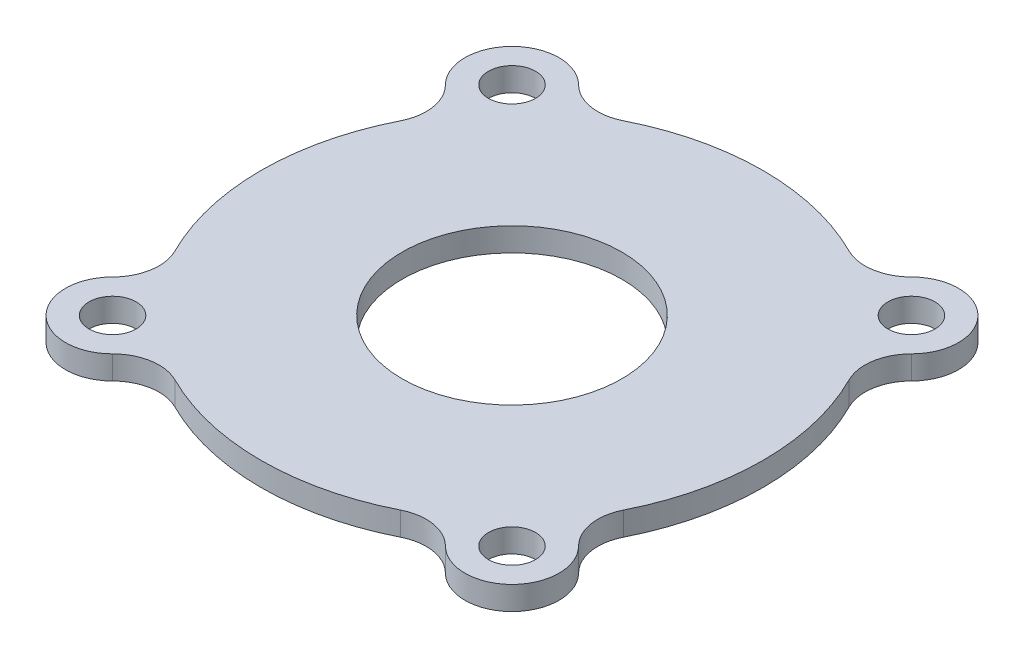
ISO-10303-21;
HEADER;
FILE_DESCRIPTION(('STEP AP214'),'2;1');
FILE_NAME('part.step','',(''),(''),'','','');
FILE_SCHEMA(('AUTOMOTIVE_DESIGN { 1 0 10303 214 1 1 1 1 }'));
ENDSEC;
DATA;
#1=APPLICATION_CONTEXT('core data for automotive mechanical design processes');
#2=APPLICATION_PROTOCOL_DEFINITION('international standard','automotive_design',2000,#1);
#3=PRODUCT_CONTEXT('',#1,'mechanical');
#4=PRODUCT('Part','Part','',(#3));
#5=PRODUCT_RELATED_PRODUCT_CATEGORY('part','',(#4));
#6=PRODUCT_DEFINITION_FORMATION('','',#4);
#7=PRODUCT_DEFINITION_CONTEXT('part definition',#1,'design');
#8=PRODUCT_DEFINITION('design','',#6,#7);
#9=PRODUCT_DEFINITION_SHAPE('','',#8);
#10=(LENGTH_UNIT() NAMED_UNIT(*) SI_UNIT(.MILLI.,.METRE.));
#11=(NAMED_UNIT(*) PLANE_ANGLE_UNIT() SI_UNIT($,.RADIAN.));
#12=(NAMED_UNIT(*) SI_UNIT($,.STERADIAN.) SOLID_ANGLE_UNIT());
#13=UNCERTAINTY_MEASURE_WITH_UNIT(LENGTH_MEASURE(1.E-05),#10,'distance_accuracy_value','');
#14=(GEOMETRIC_REPRESENTATION_CONTEXT(3) GLOBAL_UNCERTAINTY_ASSIGNED_CONTEXT((#13)) GLOBAL_UNIT_ASSIGNED_CONTEXT((#10,
#11,#12)) REPRESENTATION_CONTEXT('',''));
#15=CARTESIAN_POINT('',(0.,0.,0.));
#16=DIRECTION('',(0.,0.,1.));
#17=DIRECTION('',(1.,0.,0.));
#18=AXIS2_PLACEMENT_3D('',#15,#16,#17);
#19=CARTESIAN_POINT('',(0.,0.,0.));
#20=DIRECTION('',(0.,1.,0.));
#21=DIRECTION('',(0.,0.,1.));
#22=AXIS2_PLACEMENT_3D('',#19,#20,#21);
#23=PLANE('',#22);
#24=CARTESIAN_POINT('',(-1.47196168001604E-13,0.,-1.0794385653451E-13));
#25=DIRECTION('',(0.,1.,0.));
#26=DIRECTION('',(0.,0.,1.));
#27=AXIS2_PLACEMENT_3D('',#24,#25,#26);
#28=CIRCLE('',#27,7.);
#29=CARTESIAN_POINT('',(-1.47196168001604E-13,0.,6.99999999999989));
#30=VERTEX_POINT('',#29);
#31=EDGE_CURVE('E311',#30,#30,#28,.T.);
#32=ORIENTED_EDGE('',*,*,#31,.T.);
#33=EDGE_LOOP('',(#32));
#34=FACE_BOUND('',#33,.T.);
#35=CARTESIAN_POINT('',(-1.47196168001604E-13,0.,-1.0794385653451E-13));
#36=DIRECTION('',(0.,1.,0.));
#37=DIRECTION('',(0.,0.,1.));
#38=AXIS2_PLACEMENT_3D('',#35,#36,#37);
#39=CIRCLE('',#38,11.);
#40=CARTESIAN_POINT('',(-1.47196168001604E-13,0.,10.9999999999999));
#41=VERTEX_POINT('',#40);
#42=EDGE_CURVE('E11',#41,#41,#39,.T.);
#43=ORIENTED_EDGE('',*,*,#42,.F.);
#44=EDGE_LOOP('',(#43));
#45=FACE_BOUND('',#44,.T.);
#46=ADVANCED_FACE('F45',(#34,#45),#23,.F.);
#47=CARTESIAN_POINT('',(-12.7279220613578,1.5,12.7279220613579));
#48=DIRECTION('',(0.,-1.,0.));
#49=DIRECTION('',(0.,0.,-1.));
#50=AXIS2_PLACEMENT_3D('',#47,#48,#49);
#51=CYLINDRICAL_SURFACE('',#50,2.99999999999999);
#52=CARTESIAN_POINT('',(-12.7279220613578,0.,12.7279220613579));
#53=DIRECTION('',(0.,1.,0.));
#54=DIRECTION('',(0.,0.,1.));
#55=AXIS2_PLACEMENT_3D('',#52,#53,#54);
#56=CIRCLE('',#55,2.99999999999999);
#57=CARTESIAN_POINT('',(-10.6066017177982,0.,14.8492424049175));
#58=VERTEX_POINT('',#57);
#59=CARTESIAN_POINT('',(-14.8492424049175,0.,10.6066017177982));
#60=VERTEX_POINT('',#59);
#61=EDGE_CURVE('E261',#58,#60,#56,.F.);
#62=ORIENTED_EDGE('',*,*,#61,.F.);
#63=DIRECTION('',(0.,-1.,0.));
#64=VECTOR('',#63,1.);
#65=CARTESIAN_POINT('',(-10.6066017177982,1.5,14.8492424049175));
#66=LINE('',#65,#64);
#67=CARTESIAN_POINT('',(-10.6066017177982,1.5,14.8492424049175));
#68=VERTEX_POINT('',#67);
#69=EDGE_CURVE('E55',#68,#58,#66,.T.);
#70=ORIENTED_EDGE('',*,*,#69,.F.);
#71=CARTESIAN_POINT('',(-12.7279220613578,1.5,12.7279220613579));
#72=DIRECTION('',(0.,1.,0.));
#73=DIRECTION('',(0.,0.,1.));
#74=AXIS2_PLACEMENT_3D('',#71,#72,#73);
#75=CIRCLE('',#74,2.99999999999999);
#76=CARTESIAN_POINT('',(-14.8492424049175,1.5,10.6066017177982));
#77=VERTEX_POINT('',#76);
#78=EDGE_CURVE('E212',#68,#77,#75,.F.);
#79=ORIENTED_EDGE('',*,*,#78,.T.);
#80=DIRECTION('',(0.,-1.,0.));
#81=VECTOR('',#80,1.);
#82=CARTESIAN_POINT('',(-14.8492424049175,1.5,10.6066017177982));
#83=LINE('',#82,#81);
#84=EDGE_CURVE('E63',#77,#60,#83,.T.);
#85=ORIENTED_EDGE('',*,*,#84,.T.);
#86=EDGE_LOOP('',(#62,#70,#79,#85));
#87=FACE_BOUND('',#86,.T.);
#88=ADVANCED_FACE('F47',(#87),#51,.T.);
#89=CARTESIAN_POINT('',(-8.51247778889959,1.5,16.9433663338161));
#90=DIRECTION('',(0.,-1.,0.));
#91=DIRECTION('',(0.,0.,-1.));
#92=AXIS2_PLACEMENT_3D('',#89,#90,#91);
#93=CYLINDRICAL_SURFACE('',#92,2.96153846153845);
#94=CARTESIAN_POINT('',(-8.51247778889959,0.,16.9433663338161));
#95=DIRECTION('',(0.,1.,0.));
#96=DIRECTION('',(0.,0.,1.));
#97=AXIS2_PLACEMENT_3D('',#94,#95,#96);
#98=CIRCLE('',#97,2.96153846153845);
#99=CARTESIAN_POINT('',(-7.18294271842236,0.,14.297039340502));
#100=VERTEX_POINT('',#99);
#101=EDGE_CURVE('E264',#58,#100,#98,.F.);
#102=ORIENTED_EDGE('',*,*,#101,.T.);
#103=DIRECTION('',(0.,-1.,0.));
#104=VECTOR('',#103,1.);
#105=CARTESIAN_POINT('',(-7.18294271842236,1.5,14.297039340502));
#106=LINE('',#105,#104);
#107=CARTESIAN_POINT('',(-7.18294271842236,1.5,14.297039340502));
#108=VERTEX_POINT('',#107);
#109=EDGE_CURVE('E369',#108,#100,#106,.T.);
#110=ORIENTED_EDGE('',*,*,#109,.F.);
#111=CARTESIAN_POINT('',(-8.51247778889959,1.5,16.9433663338161));
#112=DIRECTION('',(0.,1.,0.));
#113=DIRECTION('',(0.,0.,1.));
#114=AXIS2_PLACEMENT_3D('',#111,#112,#113);
#115=CIRCLE('',#114,2.96153846153845);
#116=EDGE_CURVE('E204',#68,#108,#115,.F.);
#117=ORIENTED_EDGE('',*,*,#116,.F.);
#118=ORIENTED_EDGE('',*,*,#69,.T.);
#119=EDGE_LOOP('',(#102,#110,#117,#118));
#120=FACE_BOUND('',#119,.T.);
#121=ADVANCED_FACE('F375',(#120),#93,.F.);
#122=CARTESIAN_POINT('',(-1.47196168001604E-13,1.5,-1.0794385653451E-13));
#123=DIRECTION('',(0.,-1.,0.));
#124=DIRECTION('',(0.,0.,-1.));
#125=AXIS2_PLACEMENT_3D('',#122,#123,#124);
#126=CYLINDRICAL_SURFACE('',#125,16.);
#127=CARTESIAN_POINT('',(-1.47196168001604E-13,0.,-1.0794385653451E-13));
#128=DIRECTION('',(0.,1.,0.));
#129=DIRECTION('',(0.,0.,1.));
#130=AXIS2_PLACEMENT_3D('',#127,#128,#129);
#131=CIRCLE('',#130,16.);
#132=CARTESIAN_POINT('',(7.18294271842233,0.,14.297039340502));
#133=VERTEX_POINT('',#132);
#134=EDGE_CURVE('E268',#100,#133,#131,.T.);
#135=ORIENTED_EDGE('',*,*,#134,.T.);
#136=DIRECTION('',(0.,-1.,0.));
#137=VECTOR('',#136,1.);
#138=CARTESIAN_POINT('',(7.18294271842233,1.5,14.297039340502));
#139=LINE('',#138,#137);
#140=CARTESIAN_POINT('',(7.18294271842233,1.5,14.297039340502));
#141=VERTEX_POINT('',#140);
#142=EDGE_CURVE('E366',#141,#133,#139,.T.);
#143=ORIENTED_EDGE('',*,*,#142,.F.);
#144=CARTESIAN_POINT('',(-1.47196168001604E-13,1.5,-1.0794385653451E-13));
#145=DIRECTION('',(0.,1.,0.));
#146=DIRECTION('',(0.,0.,1.));
#147=AXIS2_PLACEMENT_3D('',#144,#145,#146);
#148=CIRCLE('',#147,16.);
#149=EDGE_CURVE('E192',#108,#141,#148,.T.);
#150=ORIENTED_EDGE('',*,*,#149,.F.);
#151=ORIENTED_EDGE('',*,*,#109,.T.);
#152=EDGE_LOOP('',(#135,#143,#150,#151));
#153=FACE_BOUND('',#152,.T.);
#154=ADVANCED_FACE('F386',(#153),#126,.T.);
#155=CARTESIAN_POINT('',(8.51247778889959,1.5,16.9433663338161));
#156=DIRECTION('',(0.,-1.,0.));
#157=DIRECTION('',(0.,0.,-1.));
#158=AXIS2_PLACEMENT_3D('',#155,#156,#157);
#159=CYLINDRICAL_SURFACE('',#158,2.96153846153846);
#160=CARTESIAN_POINT('',(8.51247778889959,0.,16.9433663338161));
#161=DIRECTION('',(0.,1.,0.));
#162=DIRECTION('',(0.,0.,1.));
#163=AXIS2_PLACEMENT_3D('',#160,#161,#162);
#164=CIRCLE('',#163,2.96153846153846);
#165=CARTESIAN_POINT('',(10.6066017177982,0.,14.8492424049175));
#166=VERTEX_POINT('',#165);
#167=EDGE_CURVE('E272',#166,#133,#164,.T.);
#168=ORIENTED_EDGE('',*,*,#167,.F.);
#169=DIRECTION('',(0.,-1.,0.));
#170=VECTOR('',#169,1.);
#171=CARTESIAN_POINT('',(10.6066017177982,1.5,14.8492424049175));
#172=LINE('',#171,#170);
#173=CARTESIAN_POINT('',(10.6066017177982,1.5,14.8492424049175));
#174=VERTEX_POINT('',#173);
#175=EDGE_CURVE('E363',#174,#166,#172,.T.);
#176=ORIENTED_EDGE('',*,*,#175,.F.);
#177=CARTESIAN_POINT('',(8.51247778889959,1.5,16.9433663338161));
#178=DIRECTION('',(0.,1.,0.));
#179=DIRECTION('',(0.,0.,1.));
#180=AXIS2_PLACEMENT_3D('',#177,#178,#179);
#181=CIRCLE('',#180,2.96153846153846);
#182=EDGE_CURVE('E203',#174,#141,#181,.T.);
#183=ORIENTED_EDGE('',*,*,#182,.T.);
#184=ORIENTED_EDGE('',*,*,#142,.T.);
#185=EDGE_LOOP('',(#168,#176,#183,#184));
#186=FACE_BOUND('',#185,.T.);
#187=ADVANCED_FACE('F466',(#186),#159,.F.);
#188=CARTESIAN_POINT('',(12.7279220613579,1.5,12.7279220613578));
#189=DIRECTION('',(0.,-1.,0.));
#190=DIRECTION('',(0.,0.,-1.));
#191=AXIS2_PLACEMENT_3D('',#188,#189,#190);
#192=CYLINDRICAL_SURFACE('',#191,3.00000000000001);
#193=CARTESIAN_POINT('',(12.7279220613579,0.,12.7279220613578));
#194=DIRECTION('',(0.,1.,0.));
#195=DIRECTION('',(0.,0.,1.));
#196=AXIS2_PLACEMENT_3D('',#193,#194,#195);
#197=CIRCLE('',#196,3.00000000000001);
#198=CARTESIAN_POINT('',(14.8492424049175,0.,10.6066017177982));
#199=VERTEX_POINT('',#198);
#200=EDGE_CURVE('E278',#199,#166,#197,.F.);
#201=ORIENTED_EDGE('',*,*,#200,.F.);
#202=DIRECTION('',(0.,-1.,0.));
#203=VECTOR('',#202,1.);
#204=CARTESIAN_POINT('',(14.8492424049175,1.5,10.6066017177982));
#205=LINE('',#204,#203);
#206=CARTESIAN_POINT('',(14.8492424049175,1.5,10.6066017177982));
#207=VERTEX_POINT('',#206);
#208=EDGE_CURVE('E360',#207,#199,#205,.T.);
#209=ORIENTED_EDGE('',*,*,#208,.F.);
#210=CARTESIAN_POINT('',(12.7279220613579,1.5,12.7279220613578));
#211=DIRECTION('',(0.,1.,0.));
#212=DIRECTION('',(0.,0.,1.));
#213=AXIS2_PLACEMENT_3D('',#210,#211,#212);
#214=CIRCLE('',#213,3.00000000000001);
#215=EDGE_CURVE('E211',#207,#174,#214,.F.);
#216=ORIENTED_EDGE('',*,*,#215,.T.);
#217=ORIENTED_EDGE('',*,*,#175,.T.);
#218=EDGE_LOOP('',(#201,#209,#216,#217));
#219=FACE_BOUND('',#218,.T.);
#220=ADVANCED_FACE('F462',(#219),#192,.T.);
#221=CARTESIAN_POINT('',(16.9433663338161,1.5,8.51247778889959));
#222=DIRECTION('',(0.,-1.,0.));
#223=DIRECTION('',(0.,0.,-1.));
#224=AXIS2_PLACEMENT_3D('',#221,#222,#223);
#225=CYLINDRICAL_SURFACE('',#224,2.96153846153845);
#226=CARTESIAN_POINT('',(16.9433663338161,0.,8.51247778889959));
#227=DIRECTION('',(0.,1.,0.));
#228=DIRECTION('',(0.,0.,1.));
#229=AXIS2_PLACEMENT_3D('',#226,#227,#228);
#230=CIRCLE('',#229,2.96153846153845);
#231=CARTESIAN_POINT('',(14.297039340502,0.,7.18294271842232));
#232=VERTEX_POINT('',#231);
#233=EDGE_CURVE('E282',#199,#232,#230,.F.);
#234=ORIENTED_EDGE('',*,*,#233,.T.);
#235=DIRECTION('',(0.,-1.,0.));
#236=VECTOR('',#235,1.);
#237=CARTESIAN_POINT('',(14.297039340502,1.5,7.18294271842232));
#238=LINE('',#237,#236);
#239=CARTESIAN_POINT('',(14.297039340502,1.5,7.18294271842232));
#240=VERTEX_POINT('',#239);
#241=EDGE_CURVE('E356',#240,#232,#238,.T.);
#242=ORIENTED_EDGE('',*,*,#241,.F.);
#243=CARTESIAN_POINT('',(16.9433663338161,1.5,8.51247778889959));
#244=DIRECTION('',(0.,1.,0.));
#245=DIRECTION('',(0.,0.,1.));
#246=AXIS2_PLACEMENT_3D('',#243,#244,#245);
#247=CIRCLE('',#246,2.96153846153845);
#248=EDGE_CURVE('E215',#207,#240,#247,.F.);
#249=ORIENTED_EDGE('',*,*,#248,.F.);
#250=ORIENTED_EDGE('',*,*,#208,.T.);
#251=EDGE_LOOP('',(#234,#242,#249,#250));
#252=FACE_BOUND('',#251,.T.);
#253=ADVANCED_FACE('F459',(#252),#225,.F.);
#254=CARTESIAN_POINT('',(14.2970393405021,0.,-7.18294271842208));
#255=VERTEX_POINT('',#254);
#256=EDGE_CURVE('E274',#232,#255,#131,.T.);
#257=ORIENTED_EDGE('',*,*,#256,.T.);
#258=DIRECTION('',(0.,-1.,0.));
#259=VECTOR('',#258,1.);
#260=CARTESIAN_POINT('',(14.2970393405021,1.5,-7.18294271842208));
#261=LINE('',#260,#259);
#262=CARTESIAN_POINT('',(14.2970393405021,1.5,-7.18294271842208));
#263=VERTEX_POINT('',#262);
#264=EDGE_CURVE('E353',#263,#255,#261,.T.);
#265=ORIENTED_EDGE('',*,*,#264,.F.);
#266=EDGE_CURVE('E201',#240,#263,#148,.T.);
#267=ORIENTED_EDGE('',*,*,#266,.F.);
#268=ORIENTED_EDGE('',*,*,#241,.T.);
#269=EDGE_LOOP('',(#257,#265,#267,#268));
#270=FACE_BOUND('',#269,.T.);
#271=ADVANCED_FACE('F457',(#270),#126,.T.);
#272=CARTESIAN_POINT('',(16.9433663338165,1.5,-8.51247778889938));
#273=DIRECTION('',(0.,-1.,0.));
#274=DIRECTION('',(0.,0.,-1.));
#275=AXIS2_PLACEMENT_3D('',#272,#273,#274);
#276=CYLINDRICAL_SURFACE('',#275,2.96153846153874);
#277=CARTESIAN_POINT('',(16.9433663338165,0.,-8.51247778889938));
#278=DIRECTION('',(0.,1.,0.));
#279=DIRECTION('',(0.,0.,1.));
#280=AXIS2_PLACEMENT_3D('',#277,#278,#279);
#281=CIRCLE('',#280,2.96153846153874);
#282=CARTESIAN_POINT('',(14.8492424049175,0.,-10.6066017177982));
#283=VERTEX_POINT('',#282);
#284=EDGE_CURVE('E285',#283,#255,#281,.T.);
#285=ORIENTED_EDGE('',*,*,#284,.F.);
#286=DIRECTION('',(0.,-1.,0.));
#287=VECTOR('',#286,1.);
#288=CARTESIAN_POINT('',(14.8492424049175,1.5,-10.6066017177982));
#289=LINE('',#288,#287);
#290=CARTESIAN_POINT('',(14.8492424049175,1.5,-10.6066017177982));
#291=VERTEX_POINT('',#290);
#292=EDGE_CURVE('E350',#291,#283,#289,.T.);
#293=ORIENTED_EDGE('',*,*,#292,.F.);
#294=CARTESIAN_POINT('',(16.9433663338165,1.5,-8.51247778889938));
#295=DIRECTION('',(0.,1.,0.));
#296=DIRECTION('',(0.,0.,1.));
#297=AXIS2_PLACEMENT_3D('',#294,#295,#296);
#298=CIRCLE('',#297,2.96153846153874);
#299=EDGE_CURVE('E214',#291,#263,#298,.T.);
#300=ORIENTED_EDGE('',*,*,#299,.T.);
#301=ORIENTED_EDGE('',*,*,#264,.T.);
#302=EDGE_LOOP('',(#285,#293,#300,#301));
#303=FACE_BOUND('',#302,.T.);
#304=ADVANCED_FACE('F453',(#303),#276,.F.);
#305=CARTESIAN_POINT('',(12.7279220613577,1.5,-12.7279220613579));
#306=DIRECTION('',(0.,-1.,0.));
#307=DIRECTION('',(0.,0.,-1.));
#308=AXIS2_PLACEMENT_3D('',#305,#306,#307);
#309=CYLINDRICAL_SURFACE('',#308,3.);
#310=CARTESIAN_POINT('',(12.7279220613577,0.,-12.7279220613579));
#311=DIRECTION('',(0.,1.,0.));
#312=DIRECTION('',(0.,0.,1.));
#313=AXIS2_PLACEMENT_3D('',#310,#311,#312);
#314=CIRCLE('',#313,3.);
#315=CARTESIAN_POINT('',(10.6066017177983,0.,-14.8492424049175));
#316=VERTEX_POINT('',#315);
#317=EDGE_CURVE('E289',#316,#283,#314,.F.);
#318=ORIENTED_EDGE('',*,*,#317,.F.);
#319=DIRECTION('',(0.,-1.,0.));
#320=VECTOR('',#319,1.);
#321=CARTESIAN_POINT('',(10.6066017177983,1.5,-14.8492424049175));
#322=LINE('',#321,#320);
#323=CARTESIAN_POINT('',(10.6066017177983,1.5,-14.8492424049175));
#324=VERTEX_POINT('',#323);
#325=EDGE_CURVE('E347',#324,#316,#322,.T.);
#326=ORIENTED_EDGE('',*,*,#325,.F.);
#327=CARTESIAN_POINT('',(12.7279220613577,1.5,-12.7279220613579));
#328=DIRECTION('',(0.,1.,0.));
#329=DIRECTION('',(0.,0.,1.));
#330=AXIS2_PLACEMENT_3D('',#327,#328,#329);
#331=CIRCLE('',#330,3.);
#332=EDGE_CURVE('E222',#324,#291,#331,.F.);
#333=ORIENTED_EDGE('',*,*,#332,.T.);
#334=ORIENTED_EDGE('',*,*,#292,.T.);
#335=EDGE_LOOP('',(#318,#326,#333,#334));
#336=FACE_BOUND('',#335,.T.);
#337=ADVANCED_FACE('F449',(#336),#309,.T.);
#338=CARTESIAN_POINT('',(8.51247778889967,1.5,-16.9433663338162));
#339=DIRECTION('',(0.,-1.,0.));
#340=DIRECTION('',(0.,0.,-1.));
#341=AXIS2_PLACEMENT_3D('',#338,#339,#340);
#342=CYLINDRICAL_SURFACE('',#341,2.96153846153866);
#343=CARTESIAN_POINT('',(8.51247778889967,0.,-16.9433663338162));
#344=DIRECTION('',(0.,1.,0.));
#345=DIRECTION('',(0.,0.,1.));
#346=AXIS2_PLACEMENT_3D('',#343,#344,#345);
#347=CIRCLE('',#346,2.96153846153866);
#348=CARTESIAN_POINT('',(7.18294271842244,0.,-14.297039340502));
#349=VERTEX_POINT('',#348);
#350=EDGE_CURVE('E293',#316,#349,#347,.F.);
#351=ORIENTED_EDGE('',*,*,#350,.T.);
#352=DIRECTION('',(0.,-1.,0.));
#353=VECTOR('',#352,1.);
#354=CARTESIAN_POINT('',(7.18294271842244,1.5,-14.297039340502));
#355=LINE('',#354,#353);
#356=CARTESIAN_POINT('',(7.18294271842244,1.5,-14.297039340502));
#357=VERTEX_POINT('',#356);
#358=EDGE_CURVE('E343',#357,#349,#355,.T.);
#359=ORIENTED_EDGE('',*,*,#358,.F.);
#360=CARTESIAN_POINT('',(8.51247778889967,1.5,-16.9433663338162));
#361=DIRECTION('',(0.,1.,0.));
#362=DIRECTION('',(0.,0.,1.));
#363=AXIS2_PLACEMENT_3D('',#360,#361,#362);
#364=CIRCLE('',#363,2.96153846153866);
#365=EDGE_CURVE('E200',#324,#357,#364,.F.);
#366=ORIENTED_EDGE('',*,*,#365,.F.);
#367=ORIENTED_EDGE('',*,*,#325,.T.);
#368=EDGE_LOOP('',(#351,#359,#366,#367));
#369=FACE_BOUND('',#368,.T.);
#370=ADVANCED_FACE('F446',(#369),#342,.F.);
#371=CARTESIAN_POINT('',(-7.18294271842241,0.,-14.2970393405021));
#372=VERTEX_POINT('',#371);
#373=EDGE_CURVE('E296',#349,#372,#131,.T.);
#374=ORIENTED_EDGE('',*,*,#373,.T.);
#375=DIRECTION('',(0.,-1.,0.));
#376=VECTOR('',#375,1.);
#377=CARTESIAN_POINT('',(-7.18294271842241,1.5,-14.2970393405021));
#378=LINE('',#377,#376);
#379=CARTESIAN_POINT('',(-7.18294271842241,1.5,-14.2970393405021));
#380=VERTEX_POINT('',#379);
#381=EDGE_CURVE('E340',#380,#372,#378,.T.);
#382=ORIENTED_EDGE('',*,*,#381,.F.);
#383=EDGE_CURVE('E191',#357,#380,#148,.T.);
#384=ORIENTED_EDGE('',*,*,#383,.F.);
#385=ORIENTED_EDGE('',*,*,#358,.T.);
#386=EDGE_LOOP('',(#374,#382,#384,#385));
#387=FACE_BOUND('',#386,.T.);
#388=ADVANCED_FACE('F435',(#387),#126,.T.);
#389=CARTESIAN_POINT('',(-8.51247778889959,1.5,-16.9433663338161));
#390=DIRECTION('',(0.,-1.,0.));
#391=DIRECTION('',(0.,0.,-1.));
#392=AXIS2_PLACEMENT_3D('',#389,#390,#391);
#393=CYLINDRICAL_SURFACE('',#392,2.96153846153845);
#394=CARTESIAN_POINT('',(-8.51247778889959,0.,-16.9433663338161));
#395=DIRECTION('',(0.,1.,0.));
#396=DIRECTION('',(0.,0.,1.));
#397=AXIS2_PLACEMENT_3D('',#394,#395,#396);
#398=CIRCLE('',#397,2.96153846153845);
#399=CARTESIAN_POINT('',(-10.6066017177982,0.,-14.8492424049175));
#400=VERTEX_POINT('',#399);
#401=EDGE_CURVE('E297',#400,#372,#398,.T.);
#402=ORIENTED_EDGE('',*,*,#401,.F.);
#403=DIRECTION('',(0.,-1.,0.));
#404=VECTOR('',#403,1.);
#405=CARTESIAN_POINT('',(-10.6066017177982,1.5,-14.8492424049175));
#406=LINE('',#405,#404);
#407=CARTESIAN_POINT('',(-10.6066017177982,1.5,-14.8492424049175));
#408=VERTEX_POINT('',#407);
#409=EDGE_CURVE('E337',#408,#400,#406,.T.);
#410=ORIENTED_EDGE('',*,*,#409,.F.);
#411=CARTESIAN_POINT('',(-8.51247778889959,1.5,-16.9433663338161));
#412=DIRECTION('',(0.,1.,0.));
#413=DIRECTION('',(0.,0.,1.));
#414=AXIS2_PLACEMENT_3D('',#411,#412,#413);
#415=CIRCLE('',#414,2.96153846153845);
#416=EDGE_CURVE('E199',#408,#380,#415,.T.);
#417=ORIENTED_EDGE('',*,*,#416,.T.);
#418=ORIENTED_EDGE('',*,*,#381,.T.);
#419=EDGE_LOOP('',(#402,#410,#417,#418));
#420=FACE_BOUND('',#419,.T.);
#421=ADVANCED_FACE('F441',(#420),#393,.F.);
#422=CARTESIAN_POINT('',(-12.7279220613578,1.5,-12.7279220613579));
#423=DIRECTION('',(0.,-1.,0.));
#424=DIRECTION('',(0.,0.,-1.));
#425=AXIS2_PLACEMENT_3D('',#422,#423,#424);
#426=CYLINDRICAL_SURFACE('',#425,3.);
#427=CARTESIAN_POINT('',(-12.7279220613578,0.,-12.7279220613579));
#428=DIRECTION('',(0.,1.,0.));
#429=DIRECTION('',(0.,0.,1.));
#430=AXIS2_PLACEMENT_3D('',#427,#428,#429);
#431=CIRCLE('',#430,3.);
#432=CARTESIAN_POINT('',(-14.8492424049175,0.,-10.6066017177982));
#433=VERTEX_POINT('',#432);
#434=EDGE_CURVE('E301',#433,#400,#431,.F.);
#435=ORIENTED_EDGE('',*,*,#434,.F.);
#436=DIRECTION('',(0.,-1.,0.));
#437=VECTOR('',#436,1.);
#438=CARTESIAN_POINT('',(-14.8492424049175,1.5,-10.6066017177982));
#439=LINE('',#438,#437);
#440=CARTESIAN_POINT('',(-14.8492424049175,1.5,-10.6066017177982));
#441=VERTEX_POINT('',#440);
#442=EDGE_CURVE('E185',#441,#433,#439,.T.);
#443=ORIENTED_EDGE('',*,*,#442,.F.);
#444=CARTESIAN_POINT('',(-12.7279220613578,1.5,-12.7279220613579));
#445=DIRECTION('',(0.,1.,0.));
#446=DIRECTION('',(0.,0.,1.));
#447=AXIS2_PLACEMENT_3D('',#444,#445,#446);
#448=CIRCLE('',#447,3.);
#449=EDGE_CURVE('E173',#441,#408,#448,.F.);
#450=ORIENTED_EDGE('',*,*,#449,.T.);
#451=ORIENTED_EDGE('',*,*,#409,.T.);
#452=EDGE_LOOP('',(#435,#443,#450,#451));
#453=FACE_BOUND('',#452,.T.);
#454=ADVANCED_FACE('F438',(#453),#426,.T.);
#455=CARTESIAN_POINT('',(-16.9433663338161,1.5,-8.51247778889959));
#456=DIRECTION('',(0.,-1.,0.));
#457=DIRECTION('',(0.,0.,-1.));
#458=AXIS2_PLACEMENT_3D('',#455,#456,#457);
#459=CYLINDRICAL_SURFACE('',#458,2.96153846153845);
#460=CARTESIAN_POINT('',(-16.9433663338161,0.,-8.51247778889959));
#461=DIRECTION('',(0.,1.,0.));
#462=DIRECTION('',(0.,0.,1.));
#463=AXIS2_PLACEMENT_3D('',#460,#461,#462);
#464=CIRCLE('',#463,2.96153846153845);
#465=CARTESIAN_POINT('',(-14.2970393405021,0.,-7.1829427184224));
#466=VERTEX_POINT('',#465);
#467=EDGE_CURVE('E181',#433,#466,#464,.F.);
#468=ORIENTED_EDGE('',*,*,#467,.T.);
#469=DIRECTION('',(0.,-1.,0.));
#470=VECTOR('',#469,1.);
#471=CARTESIAN_POINT('',(-14.2970393405021,1.5,-7.1829427184224));
#472=LINE('',#471,#470);
#473=CARTESIAN_POINT('',(-14.2970393405021,1.5,-7.1829427184224));
#474=VERTEX_POINT('',#473);
#475=EDGE_CURVE('E178',#474,#466,#472,.T.);
#476=ORIENTED_EDGE('',*,*,#475,.F.);
#477=CARTESIAN_POINT('',(-16.9433663338161,1.5,-8.51247778889959));
#478=DIRECTION('',(0.,1.,0.));
#479=DIRECTION('',(0.,0.,1.));
#480=AXIS2_PLACEMENT_3D('',#477,#478,#479);
#481=CIRCLE('',#480,2.96153846153845);
#482=EDGE_CURVE('E163',#441,#474,#481,.F.);
#483=ORIENTED_EDGE('',*,*,#482,.F.);
#484=ORIENTED_EDGE('',*,*,#442,.T.);
#485=EDGE_LOOP('',(#468,#476,#483,#484));
#486=FACE_BOUND('',#485,.T.);
#487=ADVANCED_FACE('F179',(#486),#459,.F.);
#488=CARTESIAN_POINT('',(-14.2970393405021,0.,7.18294271842239));
#489=VERTEX_POINT('',#488);
#490=EDGE_CURVE('E273',#466,#489,#131,.T.);
#491=ORIENTED_EDGE('',*,*,#490,.T.);
#492=DIRECTION('',(0.,-1.,0.));
#493=VECTOR('',#492,1.);
#494=CARTESIAN_POINT('',(-14.2970393405021,1.5,7.18294271842239));
#495=LINE('',#494,#493);
#496=CARTESIAN_POINT('',(-14.2970393405021,1.5,7.18294271842239));
#497=VERTEX_POINT('',#496);
#498=EDGE_CURVE('E114',#497,#489,#495,.T.);
#499=ORIENTED_EDGE('',*,*,#498,.F.);
#500=EDGE_CURVE('E170',#474,#497,#148,.T.);
#501=ORIENTED_EDGE('',*,*,#500,.F.);
#502=ORIENTED_EDGE('',*,*,#475,.T.);
#503=EDGE_LOOP('',(#491,#499,#501,#502));
#504=FACE_BOUND('',#503,.T.);
#505=ADVANCED_FACE('F187',(#504),#126,.T.);
#506=CARTESIAN_POINT('',(12.7279220613577,1.5,-12.7279220613579));
#507=DIRECTION('',(0.,-1.,0.));
#508=DIRECTION('',(0.,0.,-1.));
#509=AXIS2_PLACEMENT_3D('',#506,#507,#508);
#510=CYLINDRICAL_SURFACE('',#509,1.5);
#511=CARTESIAN_POINT('',(12.7279220613577,1.5,-12.7279220613579));
#512=DIRECTION('',(0.,1.,0.));
#513=DIRECTION('',(0.,0.,1.));
#514=AXIS2_PLACEMENT_3D('',#511,#512,#513);
#515=CIRCLE('',#514,1.5);
#516=CARTESIAN_POINT('',(12.7279220613577,1.5,-11.2279220613579));
#517=VERTEX_POINT('',#516);
#518=EDGE_CURVE('E253',#517,#517,#515,.T.);
#519=ORIENTED_EDGE('',*,*,#518,.T.);
#520=EDGE_LOOP('',(#519));
#521=FACE_BOUND('',#520,.T.);
#522=CARTESIAN_POINT('',(12.7279220613577,0.,-12.7279220613579));
#523=DIRECTION('',(0.,1.,0.));
#524=DIRECTION('',(0.,0.,1.));
#525=AXIS2_PLACEMENT_3D('',#522,#523,#524);
#526=CIRCLE('',#525,1.5);
#527=CARTESIAN_POINT('',(12.7279220613577,0.,-11.2279220613579));
#528=VERTEX_POINT('',#527);
#529=EDGE_CURVE('E323',#528,#528,#526,.T.);
#530=ORIENTED_EDGE('',*,*,#529,.F.);
#531=EDGE_LOOP('',(#530));
#532=FACE_BOUND('',#531,.T.);
#533=ADVANCED_FACE('F434',(#521,#532),#510,.F.);
#534=CARTESIAN_POINT('',(-12.7279220613578,1.5,-12.7279220613579));
#535=DIRECTION('',(0.,-1.,0.));
#536=DIRECTION('',(0.,0.,-1.));
#537=AXIS2_PLACEMENT_3D('',#534,#535,#536);
#538=CYLINDRICAL_SURFACE('',#537,1.5);
#539=CARTESIAN_POINT('',(-12.7279220613578,1.5,-12.7279220613579));
#540=DIRECTION('',(0.,1.,0.));
#541=DIRECTION('',(0.,0.,1.));
#542=AXIS2_PLACEMENT_3D('',#539,#540,#541);
#543=CIRCLE('',#542,1.5);
#544=CARTESIAN_POINT('',(-12.7279220613578,1.5,-11.2279220613579));
#545=VERTEX_POINT('',#544);
#546=EDGE_CURVE('E249',#545,#545,#543,.T.);
#547=ORIENTED_EDGE('',*,*,#546,.T.);
#548=EDGE_LOOP('',(#547));
#549=FACE_BOUND('',#548,.T.);
#550=CARTESIAN_POINT('',(-12.7279220613578,0.,-12.7279220613579));
#551=DIRECTION('',(0.,1.,0.));
#552=DIRECTION('',(0.,0.,1.));
#553=AXIS2_PLACEMENT_3D('',#550,#551,#552);
#554=CIRCLE('',#553,1.5);
#555=CARTESIAN_POINT('',(-12.7279220613578,0.,-11.2279220613579));
#556=VERTEX_POINT('',#555);
#557=EDGE_CURVE('E319',#556,#556,#554,.T.);
#558=ORIENTED_EDGE('',*,*,#557,.F.);
#559=EDGE_LOOP('',(#558));
#560=FACE_BOUND('',#559,.T.);
#561=ADVANCED_FACE('F567',(#549,#560),#538,.F.);
#562=CARTESIAN_POINT('',(-12.7279220613578,1.5,12.7279220613579));
#563=DIRECTION('',(0.,-1.,0.));
#564=DIRECTION('',(0.,0.,-1.));
#565=AXIS2_PLACEMENT_3D('',#562,#563,#564);
#566=CYLINDRICAL_SURFACE('',#565,1.5);
#567=CARTESIAN_POINT('',(-12.7279220613578,1.5,12.7279220613579));
#568=DIRECTION('',(0.,1.,0.));
#569=DIRECTION('',(0.,0.,1.));
#570=AXIS2_PLACEMENT_3D('',#567,#568,#569);
#571=CIRCLE('',#570,1.5);
#572=CARTESIAN_POINT('',(-12.7279220613578,1.5,14.2279220613579));
#573=VERTEX_POINT('',#572);
#574=EDGE_CURVE('E245',#573,#573,#571,.T.);
#575=ORIENTED_EDGE('',*,*,#574,.T.);
#576=EDGE_LOOP('',(#575));
#577=FACE_BOUND('',#576,.T.);
#578=CARTESIAN_POINT('',(-12.7279220613578,0.,12.7279220613579));
#579=DIRECTION('',(0.,1.,0.));
#580=DIRECTION('',(0.,0.,1.));
#581=AXIS2_PLACEMENT_3D('',#578,#579,#580);
#582=CIRCLE('',#581,1.5);
#583=CARTESIAN_POINT('',(-12.7279220613578,0.,14.2279220613579));
#584=VERTEX_POINT('',#583);
#585=EDGE_CURVE('E315',#584,#584,#582,.T.);
#586=ORIENTED_EDGE('',*,*,#585,.F.);
#587=EDGE_LOOP('',(#586));
#588=FACE_BOUND('',#587,.T.);
#589=ADVANCED_FACE('F427',(#577,#588),#566,.F.);
#590=CARTESIAN_POINT('',(-1.47196168001604E-13,1.5,-1.0794385653451E-13));
#591=DIRECTION('',(0.,-1.,0.));
#592=DIRECTION('',(0.,0.,-1.));
#593=AXIS2_PLACEMENT_3D('',#590,#591,#592);
#594=CYLINDRICAL_SURFACE('',#593,7.);
#595=CARTESIAN_POINT('',(-1.47196168001604E-13,1.5,-1.0794385653451E-13));
#596=DIRECTION('',(0.,1.,0.));
#597=DIRECTION('',(0.,0.,1.));
#598=AXIS2_PLACEMENT_3D('',#595,#596,#597);
#599=CIRCLE('',#598,7.);
#600=CARTESIAN_POINT('',(-1.47196168001604E-13,1.5,6.99999999999989));
#601=VERTEX_POINT('',#600);
#602=EDGE_CURVE('E194',#601,#601,#599,.T.);
#603=ORIENTED_EDGE('',*,*,#602,.T.);
#604=EDGE_LOOP('',(#603));
#605=FACE_BOUND('',#604,.T.);
#606=ORIENTED_EDGE('',*,*,#31,.F.);
#607=EDGE_LOOP('',(#606));
#608=FACE_BOUND('',#607,.T.);
#609=ADVANCED_FACE('F420',(#605,#608),#594,.F.);
#610=CARTESIAN_POINT('',(-16.9433663338161,1.5,8.51247778889959));
#611=DIRECTION('',(0.,-1.,0.));
#612=DIRECTION('',(0.,0.,-1.));
#613=AXIS2_PLACEMENT_3D('',#610,#611,#612);
#614=CYLINDRICAL_SURFACE('',#613,2.96153846153845);
#615=CARTESIAN_POINT('',(-16.9433663338161,0.,8.51247778889959));
#616=DIRECTION('',(0.,1.,0.));
#617=DIRECTION('',(0.,0.,1.));
#618=AXIS2_PLACEMENT_3D('',#615,#616,#617);
#619=CIRCLE('',#618,2.96153846153845);
#620=EDGE_CURVE('E307',#60,#489,#619,.T.);
#621=ORIENTED_EDGE('',*,*,#620,.F.);
#622=ORIENTED_EDGE('',*,*,#84,.F.);
#623=CARTESIAN_POINT('',(-16.9433663338161,1.5,8.51247778889959));
#624=DIRECTION('',(0.,1.,0.));
#625=DIRECTION('',(0.,0.,1.));
#626=AXIS2_PLACEMENT_3D('',#623,#624,#625);
#627=CIRCLE('',#626,2.96153846153845);
#628=EDGE_CURVE('E189',#77,#497,#627,.T.);
#629=ORIENTED_EDGE('',*,*,#628,.T.);
#630=ORIENTED_EDGE('',*,*,#498,.T.);
#631=EDGE_LOOP('',(#621,#622,#629,#630));
#632=FACE_BOUND('',#631,.T.);
#633=ADVANCED_FACE('F418',(#632),#614,.F.);
#634=CARTESIAN_POINT('',(12.7279220613579,1.5,12.7279220613578));
#635=DIRECTION('',(0.,-1.,0.));
#636=DIRECTION('',(0.,0.,-1.));
#637=AXIS2_PLACEMENT_3D('',#634,#635,#636);
#638=CYLINDRICAL_SURFACE('',#637,1.5);
#639=CARTESIAN_POINT('',(12.7279220613579,1.5,12.7279220613578));
#640=DIRECTION('',(0.,1.,0.));
#641=DIRECTION('',(0.,0.,1.));
#642=AXIS2_PLACEMENT_3D('',#639,#640,#641);
#643=CIRCLE('',#642,1.5);
#644=CARTESIAN_POINT('',(12.7279220613579,1.5,14.2279220613578));
#645=VERTEX_POINT('',#644);
#646=EDGE_CURVE('E257',#645,#645,#643,.T.);
#647=ORIENTED_EDGE('',*,*,#646,.T.);
#648=EDGE_LOOP('',(#647));
#649=FACE_BOUND('',#648,.T.);
#650=CARTESIAN_POINT('',(12.7279220613579,0.,12.7279220613578));
#651=DIRECTION('',(0.,1.,0.));
#652=DIRECTION('',(0.,0.,1.));
#653=AXIS2_PLACEMENT_3D('',#650,#651,#652);
#654=CIRCLE('',#653,1.5);
#655=CARTESIAN_POINT('',(12.7279220613579,0.,14.2279220613578));
#656=VERTEX_POINT('',#655);
#657=EDGE_CURVE('E327',#656,#656,#654,.T.);
#658=ORIENTED_EDGE('',*,*,#657,.F.);
#659=EDGE_LOOP('',(#658));
#660=FACE_BOUND('',#659,.T.);
#661=ADVANCED_FACE('F404',(#649,#660),#638,.F.);
#662=CARTESIAN_POINT('',(0.,1.5,0.));
#663=DIRECTION('',(0.,1.,0.));
#664=DIRECTION('',(0.,0.,1.));
#665=AXIS2_PLACEMENT_3D('',#662,#663,#664);
#666=PLANE('',#665);
#667=ORIENTED_EDGE('',*,*,#78,.F.);
#668=ORIENTED_EDGE('',*,*,#116,.T.);
#669=ORIENTED_EDGE('',*,*,#149,.T.);
#670=ORIENTED_EDGE('',*,*,#182,.F.);
#671=ORIENTED_EDGE('',*,*,#215,.F.);
#672=ORIENTED_EDGE('',*,*,#248,.T.);
#673=ORIENTED_EDGE('',*,*,#266,.T.);
#674=ORIENTED_EDGE('',*,*,#299,.F.);
#675=ORIENTED_EDGE('',*,*,#332,.F.);
#676=ORIENTED_EDGE('',*,*,#365,.T.);
#677=ORIENTED_EDGE('',*,*,#383,.T.);
#678=ORIENTED_EDGE('',*,*,#416,.F.);
#679=ORIENTED_EDGE('',*,*,#449,.F.);
#680=ORIENTED_EDGE('',*,*,#482,.T.);
#681=ORIENTED_EDGE('',*,*,#500,.T.);
#682=ORIENTED_EDGE('',*,*,#628,.F.);
#683=EDGE_LOOP('',(#667,#668,#669,#670,#671,#672,#673,#674,#675,#676,#677,#678,#679,#680,#681,#682));
#684=FACE_BOUND('',#683,.T.);
#685=ORIENTED_EDGE('',*,*,#602,.F.);
#686=EDGE_LOOP('',(#685));
#687=FACE_BOUND('',#686,.T.);
#688=ORIENTED_EDGE('',*,*,#574,.F.);
#689=EDGE_LOOP('',(#688));
#690=FACE_BOUND('',#689,.T.);
#691=ORIENTED_EDGE('',*,*,#546,.F.);
#692=EDGE_LOOP('',(#691));
#693=FACE_BOUND('',#692,.T.);
#694=ORIENTED_EDGE('',*,*,#518,.F.);
#695=EDGE_LOOP('',(#694));
#696=FACE_BOUND('',#695,.T.);
#697=ORIENTED_EDGE('',*,*,#646,.F.);
#698=EDGE_LOOP('',(#697));
#699=FACE_BOUND('',#698,.T.);
#700=ADVANCED_FACE('F166',(#684,#687,#690,#693,#696,#699),#666,.T.);
#701=CARTESIAN_POINT('',(-1.47196168001604E-13,0.,-1.0794385653451E-13));
#702=DIRECTION('',(0.,1.,0.));
#703=DIRECTION('',(0.,0.,1.));
#704=AXIS2_PLACEMENT_3D('',#701,#702,#703);
#705=CIRCLE('',#704,13.);
#706=CARTESIAN_POINT('',(-1.47196168001604E-13,0.,12.9999999999999));
#707=VERTEX_POINT('',#706);
#708=EDGE_CURVE('E407',#707,#707,#705,.T.);
#709=ORIENTED_EDGE('',*,*,#708,.T.);
#710=EDGE_LOOP('',(#709));
#711=FACE_BOUND('',#710,.T.);
#712=ORIENTED_EDGE('',*,*,#61,.T.);
#713=ORIENTED_EDGE('',*,*,#620,.T.);
#714=ORIENTED_EDGE('',*,*,#490,.F.);
#715=ORIENTED_EDGE('',*,*,#467,.F.);
#716=ORIENTED_EDGE('',*,*,#434,.T.);
#717=ORIENTED_EDGE('',*,*,#401,.T.);
#718=ORIENTED_EDGE('',*,*,#373,.F.);
#719=ORIENTED_EDGE('',*,*,#350,.F.);
#720=ORIENTED_EDGE('',*,*,#317,.T.);
#721=ORIENTED_EDGE('',*,*,#284,.T.);
#722=ORIENTED_EDGE('',*,*,#256,.F.);
#723=ORIENTED_EDGE('',*,*,#233,.F.);
#724=ORIENTED_EDGE('',*,*,#200,.T.);
#725=ORIENTED_EDGE('',*,*,#167,.T.);
#726=ORIENTED_EDGE('',*,*,#134,.F.);
#727=ORIENTED_EDGE('',*,*,#101,.F.);
#728=EDGE_LOOP('',(#712,#713,#714,#715,#716,#717,#718,#719,#720,#721,#722,#723,#724,#725,#726,#727));
#729=FACE_BOUND('',#728,.T.);
#730=ORIENTED_EDGE('',*,*,#585,.T.);
#731=EDGE_LOOP('',(#730));
#732=FACE_BOUND('',#731,.T.);
#733=ORIENTED_EDGE('',*,*,#557,.T.);
#734=EDGE_LOOP('',(#733));
#735=FACE_BOUND('',#734,.T.);
#736=ORIENTED_EDGE('',*,*,#529,.T.);
#737=EDGE_LOOP('',(#736));
#738=FACE_BOUND('',#737,.T.);
#739=ORIENTED_EDGE('',*,*,#657,.T.);
#740=EDGE_LOOP('',(#739));
#741=FACE_BOUND('',#740,.T.);
#742=ADVANCED_FACE('F379',(#711,#729,#732,#735,#738,#741),#23,.F.);
#743=CARTESIAN_POINT('',(-1.47196168001604E-13,-1.,-1.0794385653451E-13));
#744=DIRECTION('',(0.,1.,0.));
#745=DIRECTION('',(0.,0.,1.));
#746=AXIS2_PLACEMENT_3D('',#743,#744,#745);
#747=CYLINDRICAL_SURFACE('',#746,11.);
#748=CARTESIAN_POINT('',(-1.47196168001604E-13,-1.,-1.0794385653451E-13));
#749=DIRECTION('',(0.,1.,0.));
#750=DIRECTION('',(0.,0.,1.));
#751=AXIS2_PLACEMENT_3D('',#748,#749,#750);
#752=CIRCLE('',#751,11.);
#753=CARTESIAN_POINT('',(-1.47196168001604E-13,-1.,10.9999999999999));
#754=VERTEX_POINT('',#753);
#755=EDGE_CURVE('E410',#754,#754,#752,.T.);
#756=ORIENTED_EDGE('',*,*,#755,.F.);
#757=EDGE_LOOP('',(#756));
#758=FACE_BOUND('',#757,.T.);
#759=ORIENTED_EDGE('',*,*,#42,.T.);
#760=EDGE_LOOP('',(#759));
#761=FACE_BOUND('',#760,.T.);
#762=ADVANCED_FACE('F395',(#758,#761),#747,.F.);
#763=CARTESIAN_POINT('',(-1.47196168001604E-13,-1.,-1.0794385653451E-13));
#764=DIRECTION('',(0.,1.,0.));
#765=DIRECTION('',(0.,0.,1.));
#766=AXIS2_PLACEMENT_3D('',#763,#764,#765);
#767=CYLINDRICAL_SURFACE('',#766,13.);
#768=CARTESIAN_POINT('',(-1.47196168001604E-13,-1.,-1.0794385653451E-13));
#769=DIRECTION('',(0.,1.,0.));
#770=DIRECTION('',(0.,0.,1.));
#771=AXIS2_PLACEMENT_3D('',#768,#769,#770);
#772=CIRCLE('',#771,13.);
#773=CARTESIAN_POINT('',(-1.47196168001604E-13,-1.,12.9999999999999));
#774=VERTEX_POINT('',#773);
#775=EDGE_CURVE('E265',#774,#774,#772,.T.);
#776=ORIENTED_EDGE('',*,*,#775,.T.);
#777=EDGE_LOOP('',(#776));
#778=FACE_BOUND('',#777,.T.);
#779=ORIENTED_EDGE('',*,*,#708,.F.);
#780=EDGE_LOOP('',(#779));
#781=FACE_BOUND('',#780,.T.);
#782=ADVANCED_FACE('F401',(#778,#781),#767,.T.);
#783=CARTESIAN_POINT('',(0.,-1.,0.));
#784=DIRECTION('',(0.,1.,0.));
#785=DIRECTION('',(0.,0.,1.));
#786=AXIS2_PLACEMENT_3D('',#783,#784,#785);
#787=PLANE('',#786);
#788=ORIENTED_EDGE('',*,*,#755,.T.);
#789=EDGE_LOOP('',(#788));
#790=FACE_BOUND('',#789,.T.);
#791=ORIENTED_EDGE('',*,*,#775,.F.);
#792=EDGE_LOOP('',(#791));
#793=FACE_BOUND('',#792,.T.);
#794=ADVANCED_FACE('F501',(#790,#793),#787,.F.);
#795=CLOSED_SHELL('',(#46,#88,#121,#154,#187,#220,#253,#271,#304,#337,#370,#388,#421,#454,#487,
#505,#533,#561,#589,#609,#633,#661,#700,#742,#762,#782,#794));
#796=MANIFOLD_SOLID_BREP('B2',#795);
#797=ADVANCED_BREP_SHAPE_REPRESENTATION('',(#18,#796),#14);
#798=SHAPE_DEFINITION_REPRESENTATION(#9,#797);
ENDSEC;
END-ISO-10303-21;
